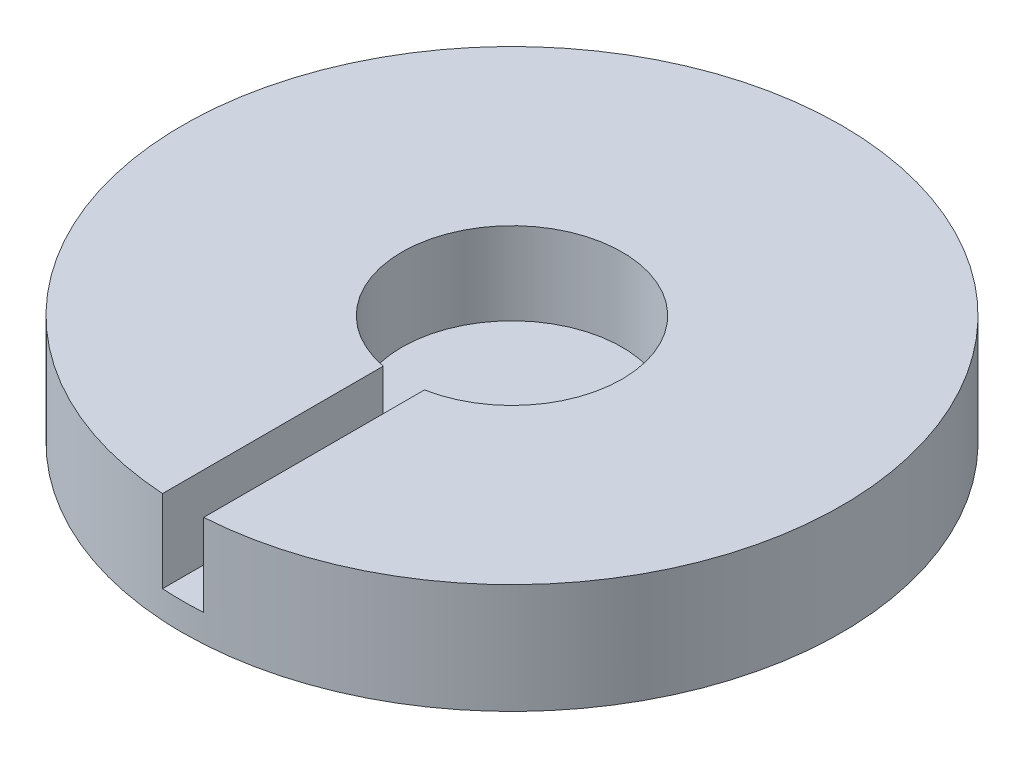
ISO-10303-21;
HEADER;
FILE_DESCRIPTION(('STEP AP214'),'2;1');
FILE_NAME('part.step','',(''),(''),'','','');
FILE_SCHEMA(('AUTOMOTIVE_DESIGN { 1 0 10303 214 1 1 1 1 }'));
ENDSEC;
DATA;
#1=APPLICATION_CONTEXT('core data for automotive mechanical design processes');
#2=APPLICATION_PROTOCOL_DEFINITION('international standard','automotive_design',2000,#1);
#3=PRODUCT_CONTEXT('',#1,'mechanical');
#4=PRODUCT('Part','Part','',(#3));
#5=PRODUCT_RELATED_PRODUCT_CATEGORY('part','',(#4));
#6=PRODUCT_DEFINITION_FORMATION('','',#4);
#7=PRODUCT_DEFINITION_CONTEXT('part definition',#1,'design');
#8=PRODUCT_DEFINITION('design','',#6,#7);
#9=PRODUCT_DEFINITION_SHAPE('','',#8);
#10=(LENGTH_UNIT() NAMED_UNIT(*) SI_UNIT(.MILLI.,.METRE.));
#11=(NAMED_UNIT(*) PLANE_ANGLE_UNIT() SI_UNIT($,.RADIAN.));
#12=(NAMED_UNIT(*) SI_UNIT($,.STERADIAN.) SOLID_ANGLE_UNIT());
#13=UNCERTAINTY_MEASURE_WITH_UNIT(LENGTH_MEASURE(1.E-05),#10,'distance_accuracy_value','');
#14=(GEOMETRIC_REPRESENTATION_CONTEXT(3) GLOBAL_UNCERTAINTY_ASSIGNED_CONTEXT((#13)) GLOBAL_UNIT_ASSIGNED_CONTEXT((#10,
#11,#12)) REPRESENTATION_CONTEXT('',''));
#15=CARTESIAN_POINT('',(0.,0.,0.));
#16=DIRECTION('',(0.,0.,1.));
#17=DIRECTION('',(1.,0.,0.));
#18=AXIS2_PLACEMENT_3D('',#15,#16,#17);
#19=CARTESIAN_POINT('',(0.,12.7,0.));
#20=DIRECTION('',(0.,-1.,0.));
#21=DIRECTION('',(0.,0.,-1.));
#22=AXIS2_PLACEMENT_3D('',#19,#20,#21);
#23=CYLINDRICAL_SURFACE('',#22,38.1);
#24=CARTESIAN_POINT('',(0.,3.175,0.));
#25=DIRECTION('',(0.,1.,0.));
#26=DIRECTION('',(0.,0.,1.));
#27=AXIS2_PLACEMENT_3D('',#24,#25,#26);
#28=CIRCLE('',#27,38.1);
#29=CARTESIAN_POINT('',(-2.38125,3.175,38.0255131252361));
#30=VERTEX_POINT('',#29);
#31=CARTESIAN_POINT('',(2.38125000000001,3.175,38.0255131252361));
#32=VERTEX_POINT('',#31);
#33=EDGE_CURVE('E86',#30,#32,#28,.T.);
#34=ORIENTED_EDGE('',*,*,#33,.F.);
#35=DIRECTION('',(0.,1.,0.));
#36=VECTOR('',#35,1.);
#37=CARTESIAN_POINT('',(-2.38125,3.175,38.0255131252361));
#38=LINE('',#37,#36);
#39=CARTESIAN_POINT('',(-2.38125,12.7,38.0255131252361));
#40=VERTEX_POINT('',#39);
#41=EDGE_CURVE('E76',#30,#40,#38,.T.);
#42=ORIENTED_EDGE('',*,*,#41,.T.);
#43=CARTESIAN_POINT('',(0.,12.7,0.));
#44=DIRECTION('',(0.,1.,0.));
#45=DIRECTION('',(0.,0.,1.));
#46=AXIS2_PLACEMENT_3D('',#43,#44,#45);
#47=CIRCLE('',#46,38.1);
#48=CARTESIAN_POINT('',(2.38125000000001,12.7,38.0255131252361));
#49=VERTEX_POINT('',#48);
#50=EDGE_CURVE('E11',#49,#40,#47,.T.);
#51=ORIENTED_EDGE('',*,*,#50,.F.);
#52=DIRECTION('',(0.,1.,0.));
#53=VECTOR('',#52,1.);
#54=CARTESIAN_POINT('',(2.38125000000001,3.175,38.0255131252361));
#55=LINE('',#54,#53);
#56=EDGE_CURVE('E49',#32,#49,#55,.T.);
#57=ORIENTED_EDGE('',*,*,#56,.F.);
#58=EDGE_LOOP('',(#34,#42,#51,#57));
#59=FACE_BOUND('',#58,.T.);
#60=CARTESIAN_POINT('',(0.,0.,0.));
#61=DIRECTION('',(0.,1.,0.));
#62=DIRECTION('',(0.,0.,1.));
#63=AXIS2_PLACEMENT_3D('',#60,#61,#62);
#64=CIRCLE('',#63,38.1);
#65=CARTESIAN_POINT('',(0.,0.,38.1));
#66=VERTEX_POINT('',#65);
#67=EDGE_CURVE('E38',#66,#66,#64,.T.);
#68=ORIENTED_EDGE('',*,*,#67,.T.);
#69=EDGE_LOOP('',(#68));
#70=FACE_BOUND('',#69,.T.);
#71=ADVANCED_FACE('F35',(#59,#70),#23,.T.);
#72=CARTESIAN_POINT('',(0.,12.7,0.));
#73=DIRECTION('',(0.,1.,0.));
#74=DIRECTION('',(0.,0.,1.));
#75=AXIS2_PLACEMENT_3D('',#72,#73,#74);
#76=PLANE('',#75);
#77=DIRECTION('',(0.,0.,1.));
#78=VECTOR('',#77,1.);
#79=CARTESIAN_POINT('',(-2.38125,12.7,0.));
#80=LINE('',#79,#78);
#81=CARTESIAN_POINT('',(-2.38125,12.7,12.5070822536673));
#82=VERTEX_POINT('',#81);
#83=EDGE_CURVE('E104',#82,#40,#80,.T.);
#84=ORIENTED_EDGE('',*,*,#83,.F.);
#85=CARTESIAN_POINT('',(0.,12.7,0.));
#86=DIRECTION('',(0.,1.,0.));
#87=DIRECTION('',(0.,0.,1.));
#88=AXIS2_PLACEMENT_3D('',#85,#86,#87);
#89=CIRCLE('',#88,12.73175);
#90=CARTESIAN_POINT('',(2.38125,12.7,12.5070822536673));
#91=VERTEX_POINT('',#90);
#92=EDGE_CURVE('E100',#91,#82,#89,.T.);
#93=ORIENTED_EDGE('',*,*,#92,.F.);
#94=DIRECTION('',(0.,0.,1.));
#95=VECTOR('',#94,1.);
#96=CARTESIAN_POINT('',(2.38125,12.7,0.));
#97=LINE('',#96,#95);
#98=EDGE_CURVE('E102',#91,#49,#97,.T.);
#99=ORIENTED_EDGE('',*,*,#98,.T.);
#100=ORIENTED_EDGE('',*,*,#50,.T.);
#101=EDGE_LOOP('',(#84,#93,#99,#100));
#102=FACE_BOUND('',#101,.T.);
#103=ADVANCED_FACE('F111',(#102),#76,.T.);
#104=CARTESIAN_POINT('',(0.,0.,0.));
#105=DIRECTION('',(0.,1.,0.));
#106=DIRECTION('',(0.,0.,1.));
#107=AXIS2_PLACEMENT_3D('',#104,#105,#106);
#108=PLANE('',#107);
#109=ORIENTED_EDGE('',*,*,#67,.F.);
#110=EDGE_LOOP('',(#109));
#111=FACE_BOUND('',#110,.T.);
#112=ADVANCED_FACE('F114',(#111),#108,.F.);
#113=CARTESIAN_POINT('',(-2.38125,3.175,0.));
#114=DIRECTION('',(-1.,0.,0.));
#115=DIRECTION('',(0.,0.,1.));
#116=AXIS2_PLACEMENT_3D('',#113,#114,#115);
#117=PLANE('',#116);
#118=ORIENTED_EDGE('',*,*,#83,.T.);
#119=ORIENTED_EDGE('',*,*,#41,.F.);
#120=DIRECTION('',(0.,0.,1.));
#121=VECTOR('',#120,1.);
#122=CARTESIAN_POINT('',(-2.38125,3.175,0.));
#123=LINE('',#122,#121);
#124=CARTESIAN_POINT('',(-2.38125,3.175,12.5070822536673));
#125=VERTEX_POINT('',#124);
#126=EDGE_CURVE('E90',#125,#30,#123,.T.);
#127=ORIENTED_EDGE('',*,*,#126,.F.);
#128=DIRECTION('',(0.,1.,0.));
#129=VECTOR('',#128,1.);
#130=CARTESIAN_POINT('',(-2.38125,3.175,12.5070822536673));
#131=LINE('',#130,#129);
#132=EDGE_CURVE('E58',#125,#82,#131,.T.);
#133=ORIENTED_EDGE('',*,*,#132,.T.);
#134=EDGE_LOOP('',(#118,#119,#127,#133));
#135=FACE_BOUND('',#134,.T.);
#136=ADVANCED_FACE('F112',(#135),#117,.F.);
#137=CARTESIAN_POINT('',(0.,3.175,0.));
#138=DIRECTION('',(0.,1.,0.));
#139=DIRECTION('',(0.,0.,1.));
#140=AXIS2_PLACEMENT_3D('',#137,#138,#139);
#141=CYLINDRICAL_SURFACE('',#140,12.73175);
#142=ORIENTED_EDGE('',*,*,#92,.T.);
#143=ORIENTED_EDGE('',*,*,#132,.F.);
#144=CARTESIAN_POINT('',(0.,3.175,0.));
#145=DIRECTION('',(0.,1.,0.));
#146=DIRECTION('',(0.,0.,1.));
#147=AXIS2_PLACEMENT_3D('',#144,#145,#146);
#148=CIRCLE('',#147,12.73175);
#149=CARTESIAN_POINT('',(2.38125,3.175,12.5070822536673));
#150=VERTEX_POINT('',#149);
#151=EDGE_CURVE('E85',#150,#125,#148,.T.);
#152=ORIENTED_EDGE('',*,*,#151,.F.);
#153=DIRECTION('',(0.,1.,0.));
#154=VECTOR('',#153,1.);
#155=CARTESIAN_POINT('',(2.38125,3.175,12.5070822536673));
#156=LINE('',#155,#154);
#157=EDGE_CURVE('E82',#150,#91,#156,.T.);
#158=ORIENTED_EDGE('',*,*,#157,.T.);
#159=EDGE_LOOP('',(#142,#143,#152,#158));
#160=FACE_BOUND('',#159,.T.);
#161=ADVANCED_FACE('F107',(#160),#141,.F.);
#162=CARTESIAN_POINT('',(2.38125,3.175,0.));
#163=DIRECTION('',(-1.,0.,0.));
#164=DIRECTION('',(0.,0.,1.));
#165=AXIS2_PLACEMENT_3D('',#162,#163,#164);
#166=PLANE('',#165);
#167=ORIENTED_EDGE('',*,*,#98,.F.);
#168=ORIENTED_EDGE('',*,*,#157,.F.);
#169=DIRECTION('',(0.,0.,1.));
#170=VECTOR('',#169,1.);
#171=CARTESIAN_POINT('',(2.38125,3.175,0.));
#172=LINE('',#171,#170);
#173=EDGE_CURVE('E79',#150,#32,#172,.T.);
#174=ORIENTED_EDGE('',*,*,#173,.T.);
#175=ORIENTED_EDGE('',*,*,#56,.T.);
#176=EDGE_LOOP('',(#167,#168,#174,#175));
#177=FACE_BOUND('',#176,.T.);
#178=ADVANCED_FACE('F81',(#177),#166,.T.);
#179=CARTESIAN_POINT('',(-83.9614213562373,3.175,0.));
#180=DIRECTION('',(0.,1.,0.));
#181=DIRECTION('',(0.,0.,1.));
#182=AXIS2_PLACEMENT_3D('',#179,#180,#181);
#183=PLANE('',#182);
#184=ORIENTED_EDGE('',*,*,#126,.T.);
#185=ORIENTED_EDGE('',*,*,#33,.T.);
#186=ORIENTED_EDGE('',*,*,#173,.F.);
#187=ORIENTED_EDGE('',*,*,#151,.T.);
#188=EDGE_LOOP('',(#184,#185,#186,#187));
#189=FACE_BOUND('',#188,.T.);
#190=ADVANCED_FACE('F89',(#189),#183,.T.);
#191=CLOSED_SHELL('',(#71,#103,#112,#136,#161,#178,#190));
#192=MANIFOLD_SOLID_BREP('B2',#191);
#193=ADVANCED_BREP_SHAPE_REPRESENTATION('',(#18,#192),#14);
#194=SHAPE_DEFINITION_REPRESENTATION(#9,#193);
ENDSEC;
END-ISO-10303-21;
